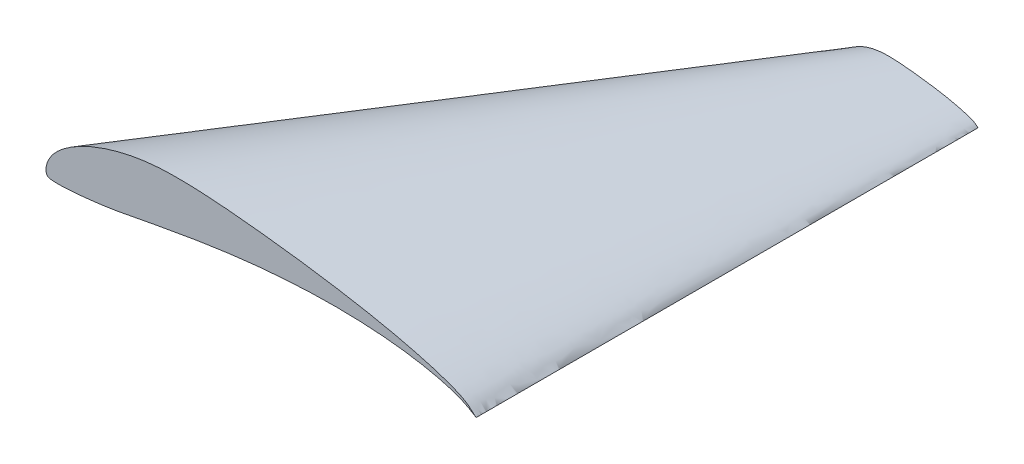
ISO-10303-21;
HEADER;
FILE_DESCRIPTION(('STEP AP214'),'2;1');
FILE_NAME('part.step','',(''),(''),'','','');
FILE_SCHEMA(('AUTOMOTIVE_DESIGN { 1 0 10303 214 1 1 1 1 }'));
ENDSEC;
DATA;
#1=APPLICATION_CONTEXT('core data for automotive mechanical design processes');
#2=APPLICATION_PROTOCOL_DEFINITION('international standard','automotive_design',2000,#1);
#3=PRODUCT_CONTEXT('',#1,'mechanical');
#4=PRODUCT('Part','Part','',(#3));
#5=PRODUCT_RELATED_PRODUCT_CATEGORY('part','',(#4));
#6=PRODUCT_DEFINITION_FORMATION('','',#4);
#7=PRODUCT_DEFINITION_CONTEXT('part definition',#1,'design');
#8=PRODUCT_DEFINITION('design','',#6,#7);
#9=PRODUCT_DEFINITION_SHAPE('','',#8);
#10=(LENGTH_UNIT() NAMED_UNIT(*) SI_UNIT(.MILLI.,.METRE.));
#11=(NAMED_UNIT(*) PLANE_ANGLE_UNIT() SI_UNIT($,.RADIAN.));
#12=(NAMED_UNIT(*) SI_UNIT($,.STERADIAN.) SOLID_ANGLE_UNIT());
#13=UNCERTAINTY_MEASURE_WITH_UNIT(LENGTH_MEASURE(1.E-05),#10,'distance_accuracy_value','');
#14=(GEOMETRIC_REPRESENTATION_CONTEXT(3) GLOBAL_UNCERTAINTY_ASSIGNED_CONTEXT((#13)) GLOBAL_UNIT_ASSIGNED_CONTEXT((#10,
#11,#12)) REPRESENTATION_CONTEXT('',''));
#15=CARTESIAN_POINT('',(0.,0.,0.));
#16=DIRECTION('',(0.,0.,1.));
#17=DIRECTION('',(1.,0.,0.));
#18=AXIS2_PLACEMENT_3D('',#15,#16,#17);
#19=CARTESIAN_POINT('',(0.,0.,0.));
#20=DIRECTION('',(0.,0.,1.));
#21=DIRECTION('',(1.,0.,0.));
#22=AXIS2_PLACEMENT_3D('',#19,#20,#21);
#23=PLANE('',#22);
#24=CARTESIAN_POINT('',(60.,0.,0.));
#25=CARTESIAN_POINT('',(59.9996335008558,-0.00155848421639207,0.));
#26=CARTESIAN_POINT('',(59.7678107009083,0.155812155482037,0.));
#27=CARTESIAN_POINT('',(59.510705283188,0.311289893981384,0.));
#28=CARTESIAN_POINT('',(58.8414335563824,0.71305828177372,0.));
#29=CARTESIAN_POINT('',(57.9336674364374,1.14757460538814,0.));
#30=CARTESIAN_POINT('',(56.6613494668884,1.62238939798338,0.));
#31=CARTESIAN_POINT('',(55.1067027969541,2.06726981959666,0.));
#32=CARTESIAN_POINT('',(53.2880024798237,2.48302860424677,0.));
#33=CARTESIAN_POINT('',(51.2387663269364,2.84900866508274,0.));
#34=CARTESIAN_POINT('',(48.9830207247781,3.15295287632235,0.));
#35=CARTESIAN_POINT('',(46.5501347587453,3.38604192261378,0.));
#36=CARTESIAN_POINT('',(43.9690733929395,3.53932870712883,0.));
#37=CARTESIAN_POINT('',(41.270873524825,3.61083541756505,0.));
#38=CARTESIAN_POINT('',(38.4864311413307,3.59888806789702,0.));
#39=CARTESIAN_POINT('',(35.6468110581785,3.5042984247576,0.));
#40=CARTESIAN_POINT('',(32.7828181702501,3.33224073356768,0.));
#41=CARTESIAN_POINT('',(29.9243738514525,3.08952194695553,0.));
#42=CARTESIAN_POINT('',(27.1001632949703,2.78246131453942,0.));
#43=CARTESIAN_POINT('',(24.3368648292331,2.42484380478589,0.));
#44=CARTESIAN_POINT('',(21.6593280235428,2.02708237663987,0.));
#45=CARTESIAN_POINT('',(19.0906277666481,1.60376835003282,0.));
#46=CARTESIAN_POINT('',(16.650692213626,1.16903728804964,0.));
#47=CARTESIAN_POINT('',(14.3574403385057,0.739204137605637,0.));
#48=CARTESIAN_POINT('',(12.2252761749415,0.332109900745339,0.));
#49=CARTESIAN_POINT('',(10.2646215673956,-0.0419478858174395,0.));
#50=CARTESIAN_POINT('',(8.46567456259763,-0.340243437522128,0.));
#51=CARTESIAN_POINT('',(6.81967624191513,-0.553670124333049,0.));
#52=CARTESIAN_POINT('',(5.3274309804443,-0.720099828376295,0.));
#53=CARTESIAN_POINT('',(3.99621535818404,-0.843103830870702,0.));
#54=CARTESIAN_POINT('',(2.8396514000118,-0.919895750020732,0.));
#55=CARTESIAN_POINT('',(1.8706104555078,-0.961682830343907,0.));
#56=CARTESIAN_POINT('',(1.10004460153965,-0.934581165480218,0.));
#57=CARTESIAN_POINT('',(0.536763933386814,-0.90661835605631,0.));
#58=CARTESIAN_POINT('',(0.117816244960925,-0.707306615975616,0.));
#59=CARTESIAN_POINT('',(0.0051098577528765,-0.305798157678561,0.));
#60=CARTESIAN_POINT('',(-0.0140169847637187,0.131974925650224,0.));
#61=CARTESIAN_POINT('',(0.0850719316488285,0.649582218808172,0.));
#62=CARTESIAN_POINT('',(0.2930234664486,1.21037036917539,0.));
#63=CARTESIAN_POINT('',(0.617494407148315,1.80101400701995,0.));
#64=CARTESIAN_POINT('',(1.05675527613261,2.40813064719845,0.));
#65=CARTESIAN_POINT('',(1.62861455630535,3.01299152689761,0.));
#66=CARTESIAN_POINT('',(2.33035140361199,3.61035853790743,0.));
#67=CARTESIAN_POINT('',(3.15178940082182,4.20675239007223,0.));
#68=CARTESIAN_POINT('',(4.09258962341009,4.78953179393415,0.));
#69=CARTESIAN_POINT('',(5.14685221592727,5.35079958311253,0.));
#70=CARTESIAN_POINT('',(6.30884164347269,5.88417305863267,0.));
#71=CARTESIAN_POINT('',(7.57483146116029,6.37882320453374,0.));
#72=CARTESIAN_POINT('',(8.93695465998708,6.83209986705336,0.));
#73=CARTESIAN_POINT('',(10.3894182556015,7.23340315512576,0.));
#74=CARTESIAN_POINT('',(11.926076695069,7.57562537309296,0.));
#75=CARTESIAN_POINT('',(13.5453512859509,7.839789441016,0.));
#76=CARTESIAN_POINT('',(15.2476328415943,8.02660789751006,0.));
#77=CARTESIAN_POINT('',(17.0398509693804,8.11879768752978,0.));
#78=CARTESIAN_POINT('',(18.9226999256131,8.12377974427893,0.));
#79=CARTESIAN_POINT('',(20.8926674686435,8.07697502334032,0.));
#80=CARTESIAN_POINT('',(22.9396617347882,7.96859227406435,0.));
#81=CARTESIAN_POINT('',(25.052294626095,7.81102981614016,0.));
#82=CARTESIAN_POINT('',(27.2184980068069,7.61270867154978,0.));
#83=CARTESIAN_POINT('',(29.4230365764783,7.38479145195094,0.));
#84=CARTESIAN_POINT('',(31.6479502828675,7.13154383170439,0.));
#85=CARTESIAN_POINT('',(33.8748202071201,6.85935611065016,0.));
#86=CARTESIAN_POINT('',(36.0858440170008,6.56630027476171,0.));
#87=CARTESIAN_POINT('',(38.2650079778576,6.25331693697473,0.));
#88=CARTESIAN_POINT('',(40.3983436281798,5.92287598001367,0.));
#89=CARTESIAN_POINT('',(42.4720640696188,5.57436949248205,0.));
#90=CARTESIAN_POINT('',(44.4741846373565,5.21215240354569,0.));
#91=CARTESIAN_POINT('',(46.3922162813386,4.8372114388325,0.));
#92=CARTESIAN_POINT('',(48.2145350695117,4.45252726033602,0.));
#93=CARTESIAN_POINT('',(49.9318628263046,4.06561454332629,0.));
#94=CARTESIAN_POINT('',(51.5282398733248,3.65993308110928,0.));
#95=CARTESIAN_POINT('',(53.0044503542957,3.27530791932623,0.));
#96=CARTESIAN_POINT('',(54.3426606505066,2.87984653664435,0.));
#97=CARTESIAN_POINT('',(55.5405906841004,2.49165505155028,0.));
#98=CARTESIAN_POINT('',(56.5905605509476,2.11038996867272,0.));
#99=CARTESIAN_POINT('',(57.4879028587413,1.73962008144949,0.));
#100=CARTESIAN_POINT('',(58.2311986071286,1.38431433802317,0.));
#101=CARTESIAN_POINT('',(58.828941407944,1.01769187040323,0.));
#102=CARTESIAN_POINT('',(59.265915035483,0.654017791026096,0.));
#103=CARTESIAN_POINT('',(59.6363051275394,0.312157693204799,0.));
#104=CARTESIAN_POINT('',(59.8031171503171,0.148486190866981,0.));
#105=CARTESIAN_POINT('',(60.0003591967076,0.00152743166866073,0.));
#106=CARTESIAN_POINT('',(60.,0.,0.));
#107=B_SPLINE_CURVE_WITH_KNOTS('',3,(#24,#25,#26,#27,#28,#29,#30,#31,#32,#33,#34,#35,#36,#37,
#38,#39,#40,#41,#42,#43,#44,#45,#46,#47,#48,#49,#50,#51,#52,#53,#54,#55,#56,#57,#58,#59,#60,#61,
#62,#63,#64,#65,#66,#67,#68,#69,#70,#71,#72,#73,#74,#75,#76,#77,#78,#79,#80,#81,#82,#83,#84,#85,
#86,#87,#88,#89,#90,#91,#92,#93,#94,#95,#96,#97,#98,#99,#100,#101,#102,#103,#104,#105,#106),
.UNSPECIFIED.,.T.,.F.,(4,1,1,1,1,1,1,1,1,1,1,1,1,1,1,1,1,1,1,1,1,1,1,1,1,1,1,1,1,1,1,1,1,1,1,1,
1,1,1,1,1,1,1,1,1,1,1,1,1,1,1,1,1,1,1,1,1,1,1,1,1,1,1,1,1,1,1,1,1,1,1,1,1,1,1,1,1,1,1,1,4),(0.,
0.000999595034815837,0.00414743774369519,0.00974821601037268,0.0180443899446245,
0.0288641991996833,0.0418308198350615,0.0567138478942355,0.0733412853564563,0.0915080547107664,
0.111021917177537,0.131661804526869,0.153207825706353,0.175433528799767,0.19811046031293,
0.221011605843273,0.243906058549397,0.266573503450726,0.288810557601415,0.31040526005058,
0.331177982251504,0.350944129706034,0.369556666419457,0.386865242588056,0.402753329919287,
0.417196176920278,0.430379829555338,0.442362952475785,0.45303248251471,0.462284679293247,
0.470026545271628,0.47617698852928,0.480650294346737,0.48355342240639,0.486421040421971,
0.489953585116172,0.494097283387753,0.498850948379478,0.504197114214733,0.51012586039696,
0.51669140420628,0.524012077500029,0.532092506534436,0.540898311322029,0.550403811222182,
0.560581445524391,0.571396895528153,0.582828501640837,0.594830070646116,0.607347475509598,
0.620384772879386,0.63396939421264,0.648200435292775,0.663194415524789,0.678899070821298,
0.695227064221376,0.712113734743953,0.729459932801066,0.747143656172896,0.765010323727239,
0.782905493395852,0.800688622999792,0.81824269546429,0.835449686152564,0.852212235831375,
0.868430205200021,0.884010000974418,0.898855600032139,0.912882485735979,0.926021793563495,
0.938166726306016,0.949289662606352,0.959322142555101,0.968216926505938,0.975948202645329,
0.982474396572986,0.987904714083922,0.992516496078862,0.996351135198454,0.999020321735725,1.),.UNSPECIFIED.);
#108=CARTESIAN_POINT('',(18.1305508783173,8.11874613514222,0.));
#109=VERTEX_POINT('',#108);
#110=CARTESIAN_POINT('',(10.0004529226697,7.12022015254232,0.));
#111=VERTEX_POINT('',#110);
#112=EDGE_CURVE('E66',#109,#111,#107,.F.);
#113=ORIENTED_EDGE('',*,*,#112,.T.);
#114=CARTESIAN_POINT('',(60.,0.,0.));
#115=CARTESIAN_POINT('',(60.0003591967076,0.00152743166866113,0.));
#116=CARTESIAN_POINT('',(59.8031171503171,0.148486190866981,0.));
#117=CARTESIAN_POINT('',(59.6363051275394,0.312157693204799,0.));
#118=CARTESIAN_POINT('',(59.265915035483,0.654017791026096,0.));
#119=CARTESIAN_POINT('',(58.828941407944,1.01769187040323,0.));
#120=CARTESIAN_POINT('',(58.2311986071286,1.38431433802317,0.));
#121=CARTESIAN_POINT('',(57.4879028587413,1.73962008144949,0.));
#122=CARTESIAN_POINT('',(56.5905605509476,2.11038996867272,0.));
#123=CARTESIAN_POINT('',(55.5405906841004,2.49165505155028,0.));
#124=CARTESIAN_POINT('',(54.3426606505066,2.87984653664435,0.));
#125=CARTESIAN_POINT('',(53.0044503542957,3.27530791932623,0.));
#126=CARTESIAN_POINT('',(51.5282398733248,3.65993308110928,0.));
#127=CARTESIAN_POINT('',(49.9318628263046,4.06561454332629,0.));
#128=CARTESIAN_POINT('',(48.2145350695117,4.45252726033602,0.));
#129=CARTESIAN_POINT('',(46.3922162813386,4.8372114388325,0.));
#130=CARTESIAN_POINT('',(44.4741846373565,5.21215240354569,0.));
#131=CARTESIAN_POINT('',(42.4720640696188,5.57436949248205,0.));
#132=CARTESIAN_POINT('',(40.3983436281798,5.92287598001367,0.));
#133=CARTESIAN_POINT('',(38.2650079778576,6.25331693697473,0.));
#134=CARTESIAN_POINT('',(36.0858440170008,6.56630027476171,0.));
#135=CARTESIAN_POINT('',(33.8748202071201,6.85935611065016,0.));
#136=CARTESIAN_POINT('',(31.6479502828675,7.13154383170439,0.));
#137=CARTESIAN_POINT('',(29.4230365764783,7.38479145195094,0.));
#138=CARTESIAN_POINT('',(27.2184980068069,7.61270867154978,0.));
#139=CARTESIAN_POINT('',(25.052294626095,7.81102981614016,0.));
#140=CARTESIAN_POINT('',(22.9396617347882,7.96859227406435,0.));
#141=CARTESIAN_POINT('',(20.8926674686435,8.07697502334032,0.));
#142=CARTESIAN_POINT('',(18.9226999256131,8.12377974427893,0.));
#143=CARTESIAN_POINT('',(17.0398509693804,8.11879768752978,0.));
#144=CARTESIAN_POINT('',(15.2476328415943,8.02660789751006,0.));
#145=CARTESIAN_POINT('',(13.5453512859509,7.839789441016,0.));
#146=CARTESIAN_POINT('',(11.926076695069,7.57562537309296,0.));
#147=CARTESIAN_POINT('',(10.3894182556015,7.23340315512576,0.));
#148=CARTESIAN_POINT('',(8.93695465998708,6.83209986705336,0.));
#149=CARTESIAN_POINT('',(7.57483146116029,6.37882320453374,0.));
#150=CARTESIAN_POINT('',(6.30884164347269,5.88417305863267,0.));
#151=CARTESIAN_POINT('',(5.14685221592727,5.35079958311253,0.));
#152=CARTESIAN_POINT('',(4.09258962341009,4.78953179393415,0.));
#153=CARTESIAN_POINT('',(3.15178940082182,4.20675239007223,0.));
#154=CARTESIAN_POINT('',(2.33035140361199,3.61035853790743,0.));
#155=CARTESIAN_POINT('',(1.62861455630535,3.01299152689761,0.));
#156=CARTESIAN_POINT('',(1.05675527613261,2.40813064719845,0.));
#157=CARTESIAN_POINT('',(0.617494407148315,1.80101400701995,0.));
#158=CARTESIAN_POINT('',(0.2930234664486,1.21037036917539,0.));
#159=CARTESIAN_POINT('',(0.0850719316488285,0.649582218808172,0.));
#160=CARTESIAN_POINT('',(-0.0140169847637187,0.131974925650224,0.));
#161=CARTESIAN_POINT('',(0.0051098577528765,-0.305798157678561,0.));
#162=CARTESIAN_POINT('',(0.117816244960925,-0.707306615975616,0.));
#163=CARTESIAN_POINT('',(0.536763933386814,-0.90661835605631,0.));
#164=CARTESIAN_POINT('',(1.10004460153965,-0.934581165480218,0.));
#165=CARTESIAN_POINT('',(1.8706104555078,-0.961682830343907,0.));
#166=CARTESIAN_POINT('',(2.8396514000118,-0.919895750020732,0.));
#167=CARTESIAN_POINT('',(3.99621535818404,-0.843103830870702,0.));
#168=CARTESIAN_POINT('',(5.3274309804443,-0.720099828376295,0.));
#169=CARTESIAN_POINT('',(6.81967624191513,-0.553670124333049,0.));
#170=CARTESIAN_POINT('',(8.46567456259763,-0.340243437522128,0.));
#171=CARTESIAN_POINT('',(10.2646215673956,-0.0419478858174395,0.));
#172=CARTESIAN_POINT('',(12.2252761749415,0.332109900745339,0.));
#173=CARTESIAN_POINT('',(14.3574403385057,0.739204137605637,0.));
#174=CARTESIAN_POINT('',(16.650692213626,1.16903728804964,0.));
#175=CARTESIAN_POINT('',(19.0906277666481,1.60376835003282,0.));
#176=CARTESIAN_POINT('',(21.6593280235428,2.02708237663987,0.));
#177=CARTESIAN_POINT('',(24.3368648292331,2.42484380478589,0.));
#178=CARTESIAN_POINT('',(27.1001632949703,2.78246131453942,0.));
#179=CARTESIAN_POINT('',(29.9243738514525,3.08952194695553,0.));
#180=CARTESIAN_POINT('',(32.7828181702501,3.33224073356768,0.));
#181=CARTESIAN_POINT('',(35.6468110581785,3.5042984247576,0.));
#182=CARTESIAN_POINT('',(38.4864311413307,3.59888806789702,0.));
#183=CARTESIAN_POINT('',(41.270873524825,3.61083541756505,0.));
#184=CARTESIAN_POINT('',(43.9690733929395,3.53932870712883,0.));
#185=CARTESIAN_POINT('',(46.5501347587453,3.38604192261378,0.));
#186=CARTESIAN_POINT('',(48.9830207247781,3.15295287632235,0.));
#187=CARTESIAN_POINT('',(51.2387663269364,2.84900866508274,0.));
#188=CARTESIAN_POINT('',(53.2880024798237,2.48302860424677,0.));
#189=CARTESIAN_POINT('',(55.1067027969541,2.06726981959666,0.));
#190=CARTESIAN_POINT('',(56.6613494668884,1.62238939798338,0.));
#191=CARTESIAN_POINT('',(57.9336674364374,1.14757460538814,0.));
#192=CARTESIAN_POINT('',(58.8414335563824,0.71305828177372,0.));
#193=CARTESIAN_POINT('',(59.510705283188,0.311289893981384,0.));
#194=CARTESIAN_POINT('',(59.7678107009083,0.155812155482037,0.));
#195=CARTESIAN_POINT('',(59.9996335008558,-0.00155848421639207,0.));
#196=CARTESIAN_POINT('',(60.,0.,0.));
#197=B_SPLINE_CURVE_WITH_KNOTS('',3,(#114,#115,#116,#117,#118,#119,#120,#121,#122,#123,#124,
#125,#126,#127,#128,#129,#130,#131,#132,#133,#134,#135,#136,#137,#138,#139,#140,#141,#142,#143,
#144,#145,#146,#147,#148,#149,#150,#151,#152,#153,#154,#155,#156,#157,#158,#159,#160,#161,#162,
#163,#164,#165,#166,#167,#168,#169,#170,#171,#172,#173,#174,#175,#176,#177,#178,#179,#180,#181,
#182,#183,#184,#185,#186,#187,#188,#189,#190,#191,#192,#193,#194,#195,#196),.UNSPECIFIED.,.T.,
.F.,(4,1,1,1,1,1,1,1,1,1,1,1,1,1,1,1,1,1,1,1,1,1,1,1,1,1,1,1,1,1,1,1,1,1,1,1,1,1,1,1,1,1,1,1,1,
1,1,1,1,1,1,1,1,1,1,1,1,1,1,1,1,1,1,1,1,1,1,1,1,1,1,1,1,1,1,1,1,1,1,1,4),(0.,
0.000979678264274593,0.00364886480154598,0.0074835039211375,0.0120952859160778,
0.0175256034270145,0.0240517973546713,0.0317830734940624,0.0406778574448995,0.0507103373936484,
0.0618332736939838,0.0739782064365048,0.0871175142640213,0.101144399967861,0.115989999025582,
0.131569794799979,0.147787764168625,0.164550313847436,0.18175730453571,0.199311377000208,
0.217094506604148,0.234989676272761,0.252856343827104,0.270540067198934,0.287886265256047,
0.304772935778624,0.321100929178702,0.336805584475211,0.351799564707225,0.36603060578736,
0.379615227120614,0.392652524490402,0.405169929353884,0.417171498359163,0.428603104471847,
0.439418554475609,0.449596188777818,0.459101688677971,0.467907493465564,0.475987922499971,
0.48330859579372,0.48987413960304,0.495802885785267,0.501149051620522,0.505902716612247,
0.510046414883828,0.513578959578029,0.51644657759361,0.519349705653263,0.52382301147072,
0.529973454728372,0.537715320706753,0.54696751748529,0.557637047524215,0.569620170444662,
0.582803823079722,0.597246670080713,0.613134757411944,0.630443333580543,0.649055870293966,
0.668822017748496,0.68959473994942,0.711189442398585,0.733426496549274,0.756093941450603,
0.778988394156727,0.80188953968707,0.824566471200233,0.846792174293647,0.868338195473131,
0.888978082822463,0.908491945289234,0.926658714643544,0.943286152105764,0.958169180164938,
0.971135800800317,0.981955610055375,0.990251783989627,0.995852562256305,0.999000404965184,1.),.UNSPECIFIED.);
#198=CARTESIAN_POINT('',(10.000052664569,-0.0805894482553418,0.));
#199=VERTEX_POINT('',#198);
#200=EDGE_CURVE('E56',#111,#199,#197,.T.);
#201=ORIENTED_EDGE('',*,*,#200,.T.);
#202=CARTESIAN_POINT('',(60.,0.,0.));
#203=CARTESIAN_POINT('',(59.9996335008558,-0.00155848421639207,0.));
#204=CARTESIAN_POINT('',(59.7678107009083,0.155812155482037,0.));
#205=CARTESIAN_POINT('',(59.510705283188,0.311289893981384,0.));
#206=CARTESIAN_POINT('',(58.8414335563824,0.71305828177372,0.));
#207=CARTESIAN_POINT('',(57.9336674364374,1.14757460538814,0.));
#208=CARTESIAN_POINT('',(56.6613494668884,1.62238939798338,0.));
#209=CARTESIAN_POINT('',(55.1067027969541,2.06726981959666,0.));
#210=CARTESIAN_POINT('',(53.2880024798237,2.48302860424677,0.));
#211=CARTESIAN_POINT('',(51.2387663269364,2.84900866508274,0.));
#212=CARTESIAN_POINT('',(48.9830207247781,3.15295287632235,0.));
#213=CARTESIAN_POINT('',(46.5501347587453,3.38604192261378,0.));
#214=CARTESIAN_POINT('',(43.9690733929395,3.53932870712883,0.));
#215=CARTESIAN_POINT('',(41.270873524825,3.61083541756505,0.));
#216=CARTESIAN_POINT('',(38.4864311413307,3.59888806789702,0.));
#217=CARTESIAN_POINT('',(35.6468110581785,3.5042984247576,0.));
#218=CARTESIAN_POINT('',(32.7828181702501,3.33224073356768,0.));
#219=CARTESIAN_POINT('',(29.9243738514525,3.08952194695553,0.));
#220=CARTESIAN_POINT('',(27.1001632949703,2.78246131453942,0.));
#221=CARTESIAN_POINT('',(24.3368648292331,2.42484380478589,0.));
#222=CARTESIAN_POINT('',(21.6593280235428,2.02708237663987,0.));
#223=CARTESIAN_POINT('',(19.0906277666481,1.60376835003282,0.));
#224=CARTESIAN_POINT('',(16.650692213626,1.16903728804964,0.));
#225=CARTESIAN_POINT('',(14.3574403385057,0.739204137605637,0.));
#226=CARTESIAN_POINT('',(12.2252761749415,0.332109900745339,0.));
#227=CARTESIAN_POINT('',(10.2646215673956,-0.0419478858174395,0.));
#228=CARTESIAN_POINT('',(8.46567456259763,-0.340243437522128,0.));
#229=CARTESIAN_POINT('',(6.81967624191513,-0.553670124333049,0.));
#230=CARTESIAN_POINT('',(5.3274309804443,-0.720099828376295,0.));
#231=CARTESIAN_POINT('',(3.99621535818404,-0.843103830870702,0.));
#232=CARTESIAN_POINT('',(2.8396514000118,-0.919895750020732,0.));
#233=CARTESIAN_POINT('',(1.8706104555078,-0.961682830343907,0.));
#234=CARTESIAN_POINT('',(1.10004460153965,-0.934581165480218,0.));
#235=CARTESIAN_POINT('',(0.536763933386814,-0.90661835605631,0.));
#236=CARTESIAN_POINT('',(0.117816244960925,-0.707306615975616,0.));
#237=CARTESIAN_POINT('',(0.0051098577528765,-0.305798157678561,0.));
#238=CARTESIAN_POINT('',(-0.0140169847637187,0.131974925650224,0.));
#239=CARTESIAN_POINT('',(0.0850719316488285,0.649582218808172,0.));
#240=CARTESIAN_POINT('',(0.2930234664486,1.21037036917539,0.));
#241=CARTESIAN_POINT('',(0.617494407148315,1.80101400701995,0.));
#242=CARTESIAN_POINT('',(1.05675527613261,2.40813064719845,0.));
#243=CARTESIAN_POINT('',(1.62861455630535,3.01299152689761,0.));
#244=CARTESIAN_POINT('',(2.33035140361199,3.61035853790743,0.));
#245=CARTESIAN_POINT('',(3.15178940082182,4.20675239007223,0.));
#246=CARTESIAN_POINT('',(4.09258962341009,4.78953179393415,0.));
#247=CARTESIAN_POINT('',(5.14685221592727,5.35079958311253,0.));
#248=CARTESIAN_POINT('',(6.30884164347269,5.88417305863267,0.));
#249=CARTESIAN_POINT('',(7.57483146116029,6.37882320453374,0.));
#250=CARTESIAN_POINT('',(8.93695465998708,6.83209986705336,0.));
#251=CARTESIAN_POINT('',(10.3894182556015,7.23340315512576,0.));
#252=CARTESIAN_POINT('',(11.926076695069,7.57562537309296,0.));
#253=CARTESIAN_POINT('',(13.5453512859509,7.839789441016,0.));
#254=CARTESIAN_POINT('',(15.2476328415943,8.02660789751006,0.));
#255=CARTESIAN_POINT('',(17.0398509693804,8.11879768752978,0.));
#256=CARTESIAN_POINT('',(18.9226999256131,8.12377974427893,0.));
#257=CARTESIAN_POINT('',(20.8926674686435,8.07697502334032,0.));
#258=CARTESIAN_POINT('',(22.9396617347882,7.96859227406435,0.));
#259=CARTESIAN_POINT('',(25.052294626095,7.81102981614016,0.));
#260=CARTESIAN_POINT('',(27.2184980068069,7.61270867154978,0.));
#261=CARTESIAN_POINT('',(29.4230365764783,7.38479145195094,0.));
#262=CARTESIAN_POINT('',(31.6479502828675,7.13154383170439,0.));
#263=CARTESIAN_POINT('',(33.8748202071201,6.85935611065016,0.));
#264=CARTESIAN_POINT('',(36.0858440170008,6.56630027476171,0.));
#265=CARTESIAN_POINT('',(38.2650079778576,6.25331693697473,0.));
#266=CARTESIAN_POINT('',(40.3983436281798,5.92287598001367,0.));
#267=CARTESIAN_POINT('',(42.4720640696188,5.57436949248205,0.));
#268=CARTESIAN_POINT('',(44.4741846373565,5.21215240354569,0.));
#269=CARTESIAN_POINT('',(46.3922162813386,4.8372114388325,0.));
#270=CARTESIAN_POINT('',(48.2145350695117,4.45252726033602,0.));
#271=CARTESIAN_POINT('',(49.9318628263046,4.06561454332629,0.));
#272=CARTESIAN_POINT('',(51.5282398733248,3.65993308110928,0.));
#273=CARTESIAN_POINT('',(53.0044503542957,3.27530791932623,0.));
#274=CARTESIAN_POINT('',(54.3426606505066,2.87984653664435,0.));
#275=CARTESIAN_POINT('',(55.5405906841004,2.49165505155028,0.));
#276=CARTESIAN_POINT('',(56.5905605509476,2.11038996867272,0.));
#277=CARTESIAN_POINT('',(57.4879028587413,1.73962008144949,0.));
#278=CARTESIAN_POINT('',(58.2311986071286,1.38431433802317,0.));
#279=CARTESIAN_POINT('',(58.828941407944,1.01769187040323,0.));
#280=CARTESIAN_POINT('',(59.265915035483,0.654017791026096,0.));
#281=CARTESIAN_POINT('',(59.6363051275394,0.312157693204799,0.));
#282=CARTESIAN_POINT('',(59.8031171503171,0.148486190866981,0.));
#283=CARTESIAN_POINT('',(60.0003591967076,0.00152743166866073,0.));
#284=CARTESIAN_POINT('',(60.,0.,0.));
#285=B_SPLINE_CURVE_WITH_KNOTS('',3,(#202,#203,#204,#205,#206,#207,#208,#209,#210,#211,#212,
#213,#214,#215,#216,#217,#218,#219,#220,#221,#222,#223,#224,#225,#226,#227,#228,#229,#230,#231,
#232,#233,#234,#235,#236,#237,#238,#239,#240,#241,#242,#243,#244,#245,#246,#247,#248,#249,#250,
#251,#252,#253,#254,#255,#256,#257,#258,#259,#260,#261,#262,#263,#264,#265,#266,#267,#268,#269,
#270,#271,#272,#273,#274,#275,#276,#277,#278,#279,#280,#281,#282,#283,#284),.UNSPECIFIED.,.T.,
.F.,(4,1,1,1,1,1,1,1,1,1,1,1,1,1,1,1,1,1,1,1,1,1,1,1,1,1,1,1,1,1,1,1,1,1,1,1,1,1,1,1,1,1,1,1,1,
1,1,1,1,1,1,1,1,1,1,1,1,1,1,1,1,1,1,1,1,1,1,1,1,1,1,1,1,1,1,1,1,1,1,1,4),(0.,
0.000999595034815837,0.00414743774369519,0.00974821601037268,0.0180443899446245,
0.0288641991996833,0.0418308198350615,0.0567138478942355,0.0733412853564563,0.0915080547107664,
0.111021917177537,0.131661804526869,0.153207825706353,0.175433528799767,0.19811046031293,
0.221011605843273,0.243906058549397,0.266573503450726,0.288810557601415,0.31040526005058,
0.331177982251504,0.350944129706034,0.369556666419457,0.386865242588056,0.402753329919287,
0.417196176920278,0.430379829555338,0.442362952475785,0.45303248251471,0.462284679293247,
0.470026545271628,0.47617698852928,0.480650294346737,0.48355342240639,0.486421040421971,
0.489953585116172,0.494097283387753,0.498850948379478,0.504197114214733,0.51012586039696,
0.51669140420628,0.524012077500029,0.532092506534436,0.540898311322029,0.550403811222182,
0.560581445524391,0.571396895528153,0.582828501640837,0.594830070646116,0.607347475509598,
0.620384772879386,0.63396939421264,0.648200435292775,0.663194415524789,0.678899070821298,
0.695227064221376,0.712113734743953,0.729459932801066,0.747143656172896,0.765010323727239,
0.782905493395852,0.800688622999792,0.81824269546429,0.835449686152564,0.852212235831375,
0.868430205200021,0.884010000974418,0.898855600032139,0.912882485735979,0.926021793563495,
0.938166726306016,0.949289662606352,0.959322142555101,0.968216926505938,0.975948202645329,
0.982474396572986,0.987904714083922,0.992516496078862,0.996351135198454,0.999020321735725,1.),.UNSPECIFIED.);
#286=CARTESIAN_POINT('',(20.8980664324314,1.89887784310203,0.));
#287=VERTEX_POINT('',#286);
#288=EDGE_CURVE('E64',#199,#287,#285,.F.);
#289=ORIENTED_EDGE('',*,*,#288,.T.);
#290=EDGE_CURVE('E43',#287,#109,#197,.T.);
#291=ORIENTED_EDGE('',*,*,#290,.T.);
#292=EDGE_LOOP('',(#113,#201,#289,#291));
#293=FACE_BOUND('',#292,.T.);
#294=ADVANCED_FACE('F33',(#293),#23,.T.);
#295=CARTESIAN_POINT('',(42.1075946681816,0.393611507106538,-70.));
#296=DIRECTION('',(0.,0.,1.));
#297=DIRECTION('',(-1.,0.,0.));
#298=AXIS2_PLACEMENT_3D('',#295,#296,#297);
#299=PLANE('',#298);
#300=CARTESIAN_POINT('',(60.,0.,-70.));
#301=CARTESIAN_POINT('',(60.0001077590123,0.00045822950059834,-70.));
#302=CARTESIAN_POINT('',(59.9409351450951,0.0445458572600942,-70.));
#303=CARTESIAN_POINT('',(59.8908915382618,0.0936473079614398,-70.));
#304=CARTESIAN_POINT('',(59.7797745106449,0.196205337307829,-70.));
#305=CARTESIAN_POINT('',(59.6486824223832,0.305307561120969,-70.));
#306=CARTESIAN_POINT('',(59.4693595821386,0.415294301406952,-70.));
#307=CARTESIAN_POINT('',(59.2463708576224,0.521886024434847,-70.));
#308=CARTESIAN_POINT('',(58.9771681652843,0.633116990601815,-70.));
#309=CARTESIAN_POINT('',(58.6621772052301,0.747496515465083,-70.));
#310=CARTESIAN_POINT('',(58.302798195152,0.863953960993304,-70.));
#311=CARTESIAN_POINT('',(57.9013351062887,0.982592375797868,-70.));
#312=CARTESIAN_POINT('',(57.4584719619975,1.09797992433278,-70.));
#313=CARTESIAN_POINT('',(56.9795588478914,1.21968436299789,-70.));
#314=CARTESIAN_POINT('',(56.4643605208535,1.33575817810081,-70.));
#315=CARTESIAN_POINT('',(55.9176648844016,1.45116343164975,-70.));
#316=CARTESIAN_POINT('',(55.3422553912069,1.56364572106371,-70.));
#317=CARTESIAN_POINT('',(54.7416192208856,1.67231084774462,-70.));
#318=CARTESIAN_POINT('',(54.119503088454,1.7768627940041,-70.));
#319=CARTESIAN_POINT('',(53.4795023933573,1.87599508109242,-70.));
#320=CARTESIAN_POINT('',(52.8257532051002,1.96989008242851,-70.));
#321=CARTESIAN_POINT('',(52.162446062136,2.05780683319505,-70.));
#322=CARTESIAN_POINT('',(51.4943850848603,2.13946314951132,-70.));
#323=CARTESIAN_POINT('',(50.8269109729435,2.21543743558528,-70.));
#324=CARTESIAN_POINT('',(50.1655494020421,2.28381260146493,-70.));
#325=CARTESIAN_POINT('',(49.5156883878285,2.34330894484205,-70.));
#326=CARTESIAN_POINT('',(48.8818985204364,2.39057768221931,-70.));
#327=CARTESIAN_POINT('',(48.2678002405931,2.42309250700209,-70.));
#328=CARTESIAN_POINT('',(47.6768099776839,2.43713392328368,-70.));
#329=CARTESIAN_POINT('',(47.1119552908141,2.43563930625894,-70.));
#330=CARTESIAN_POINT('',(46.5742898524783,2.40798236925302,-70.));
#331=CARTESIAN_POINT('',(46.0636053857853,2.3519368323048,-70.));
#332=CARTESIAN_POINT('',(45.5778230085207,2.27268761192789,-70.));
#333=CARTESIAN_POINT('',(45.1168254766805,2.17002094653773,-70.));
#334=CARTESIAN_POINT('',(44.6810863979961,2.04962996011601,-70.));
#335=CARTESIAN_POINT('',(44.2724494383481,1.91364696136012,-70.));
#336=CARTESIAN_POINT('',(43.8926524930418,1.7652519175898,-70.));
#337=CARTESIAN_POINT('',(43.5440556647782,1.60523987493376,-70.));
#338=CARTESIAN_POINT('',(43.227776887023,1.43685953818025,-70.));
#339=CARTESIAN_POINT('',(42.9455368202465,1.26202571702167,-70.));
#340=CARTESIAN_POINT('',(42.6991054210836,1.08310756137223,-70.));
#341=CARTESIAN_POINT('',(42.4885843668916,0.903897458069282,-70.));
#342=CARTESIAN_POINT('',(42.3170265828398,0.722439194159534,-70.));
#343=CARTESIAN_POINT('',(42.1852483221445,0.540304202105985,-70.));
#344=CARTESIAN_POINT('',(42.0879070399346,0.363111110752618,-70.));
#345=CARTESIAN_POINT('',(42.0255215794946,0.194874665642452,-70.));
#346=CARTESIAN_POINT('',(41.9957949045709,0.0395924776950672,-70.));
#347=CARTESIAN_POINT('',(42.0015329573259,-0.0917394473035684,-70.));
#348=CARTESIAN_POINT('',(42.0353448734883,-0.212191984792685,-70.));
#349=CARTESIAN_POINT('',(42.161029180016,-0.271985506816893,-70.));
#350=CARTESIAN_POINT('',(42.3300133804619,-0.280374349644065,-70.));
#351=CARTESIAN_POINT('',(42.5611831366523,-0.288504849103172,-70.));
#352=CARTESIAN_POINT('',(42.8518954200035,-0.27596872500622,-70.));
#353=CARTESIAN_POINT('',(43.1988646074552,-0.252931149261211,-70.));
#354=CARTESIAN_POINT('',(43.5982292941333,-0.216029948512889,-70.));
#355=CARTESIAN_POINT('',(44.0459028725745,-0.166101037299915,-70.));
#356=CARTESIAN_POINT('',(44.5397023687793,-0.102073031256638,-70.));
#357=CARTESIAN_POINT('',(45.0793864702187,-0.0125843657452318,-70.));
#358=CARTESIAN_POINT('',(45.6675828524825,0.0996329702236017,-70.));
#359=CARTESIAN_POINT('',(46.3072321015517,0.221761241281691,-70.));
#360=CARTESIAN_POINT('',(46.9952076640878,0.350711186414893,-70.));
#361=CARTESIAN_POINT('',(47.7271883299944,0.481130505009847,-70.));
#362=CARTESIAN_POINT('',(48.4977984070628,0.608124712991961,-70.));
#363=CARTESIAN_POINT('',(49.3010594487699,0.727453141435768,-70.));
#364=CARTESIAN_POINT('',(50.1300489884911,0.834738394361826,-70.));
#365=CARTESIAN_POINT('',(50.9773121554357,0.926856584086659,-70.));
#366=CARTESIAN_POINT('',(51.834845451075,0.999672220070305,-70.));
#367=CARTESIAN_POINT('',(52.6940433174535,1.05128952742728,-70.));
#368=CARTESIAN_POINT('',(53.5459293423992,1.07966642036911,-70.));
#369=CARTESIAN_POINT('',(54.3812620574475,1.08325062526952,-70.));
#370=CARTESIAN_POINT('',(55.1907220178818,1.06179861213865,-70.));
#371=CARTESIAN_POINT('',(55.9650404276236,1.01581257678414,-70.));
#372=CARTESIAN_POINT('',(56.6949062174334,0.945885862896706,-70.));
#373=CARTESIAN_POINT('',(57.3716298980809,0.854702599524822,-70.));
#374=CARTESIAN_POINT('',(57.9864007439471,0.744908581274031,-70.));
#375=CARTESIAN_POINT('',(58.5320108390862,0.620180945878999,-70.));
#376=CARTESIAN_POINT('',(58.9984048400665,0.486716819395014,-70.));
#377=CARTESIAN_POINT('',(59.3801002309312,0.344272381616441,-70.));
#378=CARTESIAN_POINT('',(59.6524300669147,0.213917484532116,-70.));
#379=CARTESIAN_POINT('',(59.8532115849564,0.0933869681944152,-70.));
#380=CARTESIAN_POINT('',(59.9303432102725,0.0467436466446112,-70.));
#381=CARTESIAN_POINT('',(59.9998900502568,-0.000467545264917618,-70.));
#382=CARTESIAN_POINT('',(60.,0.,-70.));
#383=B_SPLINE_CURVE_WITH_KNOTS('',3,(#300,#301,#302,#303,#304,#305,#306,#307,#308,#309,#310,
#311,#312,#313,#314,#315,#316,#317,#318,#319,#320,#321,#322,#323,#324,#325,#326,#327,#328,#329,
#330,#331,#332,#333,#334,#335,#336,#337,#338,#339,#340,#341,#342,#343,#344,#345,#346,#347,#348,
#349,#350,#351,#352,#353,#354,#355,#356,#357,#358,#359,#360,#361,#362,#363,#364,#365,#366,#367,
#368,#369,#370,#371,#372,#373,#374,#375,#376,#377,#378,#379,#380,#381,#382),.UNSPECIFIED.,.T.,
.F.,(4,1,1,1,1,1,1,1,1,1,1,1,1,1,1,1,1,1,1,1,1,1,1,1,1,1,1,1,1,1,1,1,1,1,1,1,1,1,1,1,1,1,1,1,1,
1,1,1,1,1,1,1,1,1,1,1,1,1,1,1,1,1,1,1,1,1,1,1,1,1,1,1,1,1,1,1,1,1,1,1,4),(0.,
0.000979678264274593,0.00364886480154598,0.0074835039211375,0.0120952859160778,
0.0175256034270145,0.0240517973546713,0.0317830734940624,0.0406778574448995,0.0507103373936484,
0.0618332736939838,0.0739782064365048,0.0871175142640213,0.101144399967861,0.115989999025582,
0.131569794799979,0.147787764168625,0.164550313847436,0.18175730453571,0.199311377000208,
0.217094506604148,0.234989676272761,0.252856343827104,0.270540067198934,0.287886265256047,
0.304772935778624,0.321100929178702,0.336805584475211,0.351799564707225,0.36603060578736,
0.379615227120614,0.392652524490402,0.405169929353884,0.417171498359163,0.428603104471847,
0.439418554475609,0.449596188777818,0.459101688677971,0.467907493465564,0.475987922499971,
0.48330859579372,0.48987413960304,0.495802885785267,0.501149051620522,0.505902716612247,
0.510046414883828,0.513578959578029,0.51644657759361,0.519349705653263,0.52382301147072,
0.529973454728372,0.537715320706753,0.54696751748529,0.557637047524215,0.569620170444662,
0.582803823079722,0.597246670080713,0.613134757411944,0.630443333580543,0.649055870293966,
0.668822017748496,0.68959473994942,0.711189442398585,0.733426496549274,0.756093941450603,
0.778988394156727,0.80188953968707,0.824566471200233,0.846792174293647,0.868338195473131,
0.888978082822463,0.908491945289234,0.926658714643544,0.943286152105764,0.958169180164938,
0.971135800800317,0.981955610055375,0.990251783989627,0.995852562256305,0.999000404965184,1.),.UNSPECIFIED.);
#384=CARTESIAN_POINT('',(60.,0.,-70.));
#385=VERTEX_POINT('',#384);
#386=EDGE_CURVE('E11',#385,#385,#383,.T.);
#387=ORIENTED_EDGE('',*,*,#386,.F.);
#388=EDGE_LOOP('',(#387));
#389=FACE_BOUND('',#388,.T.);
#390=ADVANCED_FACE('F94',(#389),#299,.F.);
#391=CARTESIAN_POINT('',(60.,0.,-70.));
#392=CARTESIAN_POINT('',(60.,0.,0.));
#393=CARTESIAN_POINT('',(59.9998900502568,-0.000467545264917618,-70.));
#394=CARTESIAN_POINT('',(59.9996335008558,-0.00155848421639207,0.));
#395=CARTESIAN_POINT('',(59.9303432102725,0.0467436466446112,-70.));
#396=CARTESIAN_POINT('',(59.7678107009083,0.155812155482037,0.));
#397=CARTESIAN_POINT('',(59.8532115849564,0.0933869681944152,-70.));
#398=CARTESIAN_POINT('',(59.510705283188,0.311289893981384,0.));
#399=CARTESIAN_POINT('',(59.6524300669147,0.213917484532116,-70.));
#400=CARTESIAN_POINT('',(58.8414335563824,0.71305828177372,0.));
#401=CARTESIAN_POINT('',(59.3801002309312,0.344272381616441,-70.));
#402=CARTESIAN_POINT('',(57.9336674364374,1.14757460538814,0.));
#403=CARTESIAN_POINT('',(58.9984048400665,0.486716819395014,-70.));
#404=CARTESIAN_POINT('',(56.6613494668884,1.62238939798338,0.));
#405=CARTESIAN_POINT('',(58.5320108390862,0.620180945878999,-70.));
#406=CARTESIAN_POINT('',(55.1067027969541,2.06726981959666,0.));
#407=CARTESIAN_POINT('',(57.9864007439471,0.744908581274031,-70.));
#408=CARTESIAN_POINT('',(53.2880024798237,2.48302860424677,0.));
#409=CARTESIAN_POINT('',(57.3716298980809,0.854702599524822,-70.));
#410=CARTESIAN_POINT('',(51.2387663269364,2.84900866508274,0.));
#411=CARTESIAN_POINT('',(56.6949062174334,0.945885862896706,-70.));
#412=CARTESIAN_POINT('',(48.9830207247781,3.15295287632235,0.));
#413=CARTESIAN_POINT('',(55.9650404276236,1.01581257678414,-70.));
#414=CARTESIAN_POINT('',(46.5501347587453,3.38604192261378,0.));
#415=CARTESIAN_POINT('',(55.1907220178818,1.06179861213865,-70.));
#416=CARTESIAN_POINT('',(43.9690733929395,3.53932870712883,0.));
#417=CARTESIAN_POINT('',(54.3812620574475,1.08325062526952,-70.));
#418=CARTESIAN_POINT('',(41.270873524825,3.61083541756505,0.));
#419=CARTESIAN_POINT('',(53.5459293423992,1.07966642036911,-70.));
#420=CARTESIAN_POINT('',(38.4864311413307,3.59888806789702,0.));
#421=CARTESIAN_POINT('',(52.6940433174535,1.05128952742728,-70.));
#422=CARTESIAN_POINT('',(35.6468110581785,3.5042984247576,0.));
#423=CARTESIAN_POINT('',(51.834845451075,0.999672220070305,-70.));
#424=CARTESIAN_POINT('',(32.7828181702501,3.33224073356768,0.));
#425=CARTESIAN_POINT('',(50.9773121554357,0.926856584086659,-70.));
#426=CARTESIAN_POINT('',(29.9243738514525,3.08952194695553,0.));
#427=CARTESIAN_POINT('',(50.1300489884911,0.834738394361826,-70.));
#428=CARTESIAN_POINT('',(27.1001632949703,2.78246131453942,0.));
#429=CARTESIAN_POINT('',(49.3010594487699,0.727453141435768,-70.));
#430=CARTESIAN_POINT('',(24.3368648292331,2.42484380478589,0.));
#431=CARTESIAN_POINT('',(48.4977984070628,0.608124712991961,-70.));
#432=CARTESIAN_POINT('',(21.6593280235428,2.02708237663987,0.));
#433=CARTESIAN_POINT('',(47.7271883299944,0.481130505009847,-70.));
#434=CARTESIAN_POINT('',(19.0906277666481,1.60376835003282,0.));
#435=CARTESIAN_POINT('',(46.9952076640878,0.350711186414893,-70.));
#436=CARTESIAN_POINT('',(16.650692213626,1.16903728804964,0.));
#437=CARTESIAN_POINT('',(46.3072321015517,0.221761241281691,-70.));
#438=CARTESIAN_POINT('',(14.3574403385057,0.739204137605637,0.));
#439=CARTESIAN_POINT('',(45.6675828524825,0.0996329702236017,-70.));
#440=CARTESIAN_POINT('',(12.2252761749415,0.332109900745339,0.));
#441=CARTESIAN_POINT('',(45.0793864702187,-0.0125843657452318,-70.));
#442=CARTESIAN_POINT('',(10.2646215673956,-0.0419478858174395,0.));
#443=CARTESIAN_POINT('',(44.5397023687793,-0.102073031256638,-70.));
#444=CARTESIAN_POINT('',(8.46567456259763,-0.340243437522128,0.));
#445=CARTESIAN_POINT('',(44.0459028725745,-0.166101037299915,-70.));
#446=CARTESIAN_POINT('',(6.81967624191513,-0.553670124333049,0.));
#447=CARTESIAN_POINT('',(43.5982292941333,-0.216029948512889,-70.));
#448=CARTESIAN_POINT('',(5.3274309804443,-0.720099828376295,0.));
#449=CARTESIAN_POINT('',(43.1988646074552,-0.252931149261211,-70.));
#450=CARTESIAN_POINT('',(3.99621535818404,-0.843103830870702,0.));
#451=CARTESIAN_POINT('',(42.8518954200035,-0.27596872500622,-70.));
#452=CARTESIAN_POINT('',(2.8396514000118,-0.919895750020732,0.));
#453=CARTESIAN_POINT('',(42.5611831366523,-0.288504849103172,-70.));
#454=CARTESIAN_POINT('',(1.8706104555078,-0.961682830343907,0.));
#455=CARTESIAN_POINT('',(42.3300133804619,-0.280374349644065,-70.));
#456=CARTESIAN_POINT('',(1.10004460153965,-0.934581165480218,0.));
#457=CARTESIAN_POINT('',(42.161029180016,-0.271985506816893,-70.));
#458=CARTESIAN_POINT('',(0.536763933386814,-0.90661835605631,0.));
#459=CARTESIAN_POINT('',(42.0353448734883,-0.212191984792685,-70.));
#460=CARTESIAN_POINT('',(0.117816244960925,-0.707306615975616,0.));
#461=CARTESIAN_POINT('',(42.0015329573259,-0.0917394473035684,-70.));
#462=CARTESIAN_POINT('',(0.0051098577528765,-0.305798157678561,0.));
#463=CARTESIAN_POINT('',(41.9957949045709,0.0395924776950672,-70.));
#464=CARTESIAN_POINT('',(-0.0140169847637187,0.131974925650224,0.));
#465=CARTESIAN_POINT('',(42.0255215794946,0.194874665642452,-70.));
#466=CARTESIAN_POINT('',(0.0850719316488285,0.649582218808172,0.));
#467=CARTESIAN_POINT('',(42.0879070399346,0.363111110752618,-70.));
#468=CARTESIAN_POINT('',(0.2930234664486,1.21037036917539,0.));
#469=CARTESIAN_POINT('',(42.1852483221445,0.540304202105985,-70.));
#470=CARTESIAN_POINT('',(0.617494407148315,1.80101400701995,0.));
#471=CARTESIAN_POINT('',(42.3170265828398,0.722439194159534,-70.));
#472=CARTESIAN_POINT('',(1.05675527613261,2.40813064719845,0.));
#473=CARTESIAN_POINT('',(42.4885843668916,0.903897458069282,-70.));
#474=CARTESIAN_POINT('',(1.62861455630535,3.01299152689761,0.));
#475=CARTESIAN_POINT('',(42.6991054210836,1.08310756137223,-70.));
#476=CARTESIAN_POINT('',(2.33035140361199,3.61035853790743,0.));
#477=CARTESIAN_POINT('',(42.9455368202465,1.26202571702167,-70.));
#478=CARTESIAN_POINT('',(3.15178940082182,4.20675239007223,0.));
#479=CARTESIAN_POINT('',(43.227776887023,1.43685953818025,-70.));
#480=CARTESIAN_POINT('',(4.09258962341009,4.78953179393415,0.));
#481=CARTESIAN_POINT('',(43.5440556647782,1.60523987493376,-70.));
#482=CARTESIAN_POINT('',(5.14685221592727,5.35079958311253,0.));
#483=CARTESIAN_POINT('',(43.8926524930418,1.7652519175898,-70.));
#484=CARTESIAN_POINT('',(6.30884164347269,5.88417305863267,0.));
#485=CARTESIAN_POINT('',(44.2724494383481,1.91364696136012,-70.));
#486=CARTESIAN_POINT('',(7.57483146116029,6.37882320453374,0.));
#487=CARTESIAN_POINT('',(44.6810863979961,2.04962996011601,-70.));
#488=CARTESIAN_POINT('',(8.93695465998708,6.83209986705336,0.));
#489=CARTESIAN_POINT('',(45.1168254766805,2.17002094653773,-70.));
#490=CARTESIAN_POINT('',(10.3894182556015,7.23340315512576,0.));
#491=CARTESIAN_POINT('',(45.5778230085207,2.27268761192789,-70.));
#492=CARTESIAN_POINT('',(11.926076695069,7.57562537309296,0.));
#493=CARTESIAN_POINT('',(46.0636053857853,2.3519368323048,-70.));
#494=CARTESIAN_POINT('',(13.5453512859509,7.839789441016,0.));
#495=CARTESIAN_POINT('',(46.5742898524783,2.40798236925302,-70.));
#496=CARTESIAN_POINT('',(15.2476328415943,8.02660789751006,0.));
#497=CARTESIAN_POINT('',(47.1119552908141,2.43563930625894,-70.));
#498=CARTESIAN_POINT('',(17.0398509693804,8.11879768752978,0.));
#499=CARTESIAN_POINT('',(47.6768099776839,2.43713392328368,-70.));
#500=CARTESIAN_POINT('',(18.9226999256131,8.12377974427893,0.));
#501=CARTESIAN_POINT('',(48.2678002405931,2.42309250700209,-70.));
#502=CARTESIAN_POINT('',(20.8926674686435,8.07697502334032,0.));
#503=CARTESIAN_POINT('',(48.8818985204364,2.39057768221931,-70.));
#504=CARTESIAN_POINT('',(22.9396617347882,7.96859227406435,0.));
#505=CARTESIAN_POINT('',(49.5156883878285,2.34330894484205,-70.));
#506=CARTESIAN_POINT('',(25.052294626095,7.81102981614016,0.));
#507=CARTESIAN_POINT('',(50.1655494020421,2.28381260146493,-70.));
#508=CARTESIAN_POINT('',(27.2184980068069,7.61270867154978,0.));
#509=CARTESIAN_POINT('',(50.8269109729435,2.21543743558528,-70.));
#510=CARTESIAN_POINT('',(29.4230365764783,7.38479145195094,0.));
#511=CARTESIAN_POINT('',(51.4943850848603,2.13946314951132,-70.));
#512=CARTESIAN_POINT('',(31.6479502828675,7.13154383170439,0.));
#513=CARTESIAN_POINT('',(52.162446062136,2.05780683319505,-70.));
#514=CARTESIAN_POINT('',(33.8748202071201,6.85935611065016,0.));
#515=CARTESIAN_POINT('',(52.8257532051002,1.96989008242851,-70.));
#516=CARTESIAN_POINT('',(36.0858440170008,6.56630027476171,0.));
#517=CARTESIAN_POINT('',(53.4795023933573,1.87599508109242,-70.));
#518=CARTESIAN_POINT('',(38.2650079778576,6.25331693697473,0.));
#519=CARTESIAN_POINT('',(54.119503088454,1.7768627940041,-70.));
#520=CARTESIAN_POINT('',(40.3983436281798,5.92287598001367,0.));
#521=CARTESIAN_POINT('',(54.7416192208856,1.67231084774462,-70.));
#522=CARTESIAN_POINT('',(42.4720640696188,5.57436949248205,0.));
#523=CARTESIAN_POINT('',(55.3422553912069,1.56364572106371,-70.));
#524=CARTESIAN_POINT('',(44.4741846373565,5.21215240354569,0.));
#525=CARTESIAN_POINT('',(55.9176648844016,1.45116343164975,-70.));
#526=CARTESIAN_POINT('',(46.3922162813386,4.8372114388325,0.));
#527=CARTESIAN_POINT('',(56.4643605208535,1.33575817810081,-70.));
#528=CARTESIAN_POINT('',(48.2145350695117,4.45252726033602,0.));
#529=CARTESIAN_POINT('',(56.9795588478914,1.21968436299789,-70.));
#530=CARTESIAN_POINT('',(49.9318628263046,4.06561454332629,0.));
#531=CARTESIAN_POINT('',(57.4584719619975,1.09797992433278,-70.));
#532=CARTESIAN_POINT('',(51.5282398733248,3.65993308110928,0.));
#533=CARTESIAN_POINT('',(57.9013351062887,0.982592375797868,-70.));
#534=CARTESIAN_POINT('',(53.0044503542957,3.27530791932623,0.));
#535=CARTESIAN_POINT('',(58.302798195152,0.863953960993304,-70.));
#536=CARTESIAN_POINT('',(54.3426606505066,2.87984653664435,0.));
#537=CARTESIAN_POINT('',(58.6621772052301,0.747496515465083,-70.));
#538=CARTESIAN_POINT('',(55.5405906841004,2.49165505155028,0.));
#539=CARTESIAN_POINT('',(58.9771681652843,0.633116990601815,-70.));
#540=CARTESIAN_POINT('',(56.5905605509476,2.11038996867272,0.));
#541=CARTESIAN_POINT('',(59.2463708576224,0.521886024434847,-70.));
#542=CARTESIAN_POINT('',(57.4879028587413,1.73962008144949,0.));
#543=CARTESIAN_POINT('',(59.4693595821386,0.415294301406952,-70.));
#544=CARTESIAN_POINT('',(58.2311986071286,1.38431433802317,0.));
#545=CARTESIAN_POINT('',(59.6486824223832,0.305307561120969,-70.));
#546=CARTESIAN_POINT('',(58.828941407944,1.01769187040323,0.));
#547=CARTESIAN_POINT('',(59.7797745106449,0.196205337307829,-70.));
#548=CARTESIAN_POINT('',(59.265915035483,0.654017791026096,0.));
#549=CARTESIAN_POINT('',(59.8908915382618,0.0936473079614398,-70.));
#550=CARTESIAN_POINT('',(59.6363051275394,0.312157693204799,0.));
#551=CARTESIAN_POINT('',(59.9409351450951,0.0445458572600942,-70.));
#552=CARTESIAN_POINT('',(59.8031171503171,0.148486190866981,0.));
#553=CARTESIAN_POINT('',(60.0001077590123,0.000458229500598223,-70.));
#554=CARTESIAN_POINT('',(60.0003591967076,0.00152743166866073,0.));
#555=CARTESIAN_POINT('',(60.,0.,-70.));
#556=CARTESIAN_POINT('',(60.,0.,0.));
#557=B_SPLINE_SURFACE_WITH_KNOTS('',3,1,((#391,#392),(#393,#394),(#395,#396),(#397,#398),(#399,
#400),(#401,#402),(#403,#404),(#405,#406),(#407,#408),(#409,#410),(#411,#412),(#413,#414),(#415,
#416),(#417,#418),(#419,#420),(#421,#422),(#423,#424),(#425,#426),(#427,#428),(#429,#430),(#431,
#432),(#433,#434),(#435,#436),(#437,#438),(#439,#440),(#441,#442),(#443,#444),(#445,#446),(#447,
#448),(#449,#450),(#451,#452),(#453,#454),(#455,#456),(#457,#458),(#459,#460),(#461,#462),(#463,
#464),(#465,#466),(#467,#468),(#469,#470),(#471,#472),(#473,#474),(#475,#476),(#477,#478),(#479,
#480),(#481,#482),(#483,#484),(#485,#486),(#487,#488),(#489,#490),(#491,#492),(#493,#494),(#495,
#496),(#497,#498),(#499,#500),(#501,#502),(#503,#504),(#505,#506),(#507,#508),(#509,#510),(#511,
#512),(#513,#514),(#515,#516),(#517,#518),(#519,#520),(#521,#522),(#523,#524),(#525,#526),(#527,
#528),(#529,#530),(#531,#532),(#533,#534),(#535,#536),(#537,#538),(#539,#540),(#541,#542),(#543,
#544),(#545,#546),(#547,#548),(#549,#550),(#551,#552),(#553,#554),(#555,#556)),.UNSPECIFIED.,
.T.,.F.,.F.,(4,1,1,1,1,1,1,1,1,1,1,1,1,1,1,1,1,1,1,1,1,1,1,1,1,1,1,1,1,1,1,1,1,1,1,1,1,1,1,1,1,
1,1,1,1,1,1,1,1,1,1,1,1,1,1,1,1,1,1,1,1,1,1,1,1,1,1,1,1,1,1,1,1,1,1,1,1,1,1,1,4),(2,2),(0.,
0.000999595034815837,0.00414743774369519,0.00974821601037268,0.0180443899446245,
0.0288641991996833,0.0418308198350615,0.0567138478942355,0.0733412853564563,0.0915080547107664,
0.111021917177537,0.131661804526869,0.153207825706353,0.175433528799767,0.19811046031293,
0.221011605843273,0.243906058549397,0.266573503450726,0.288810557601415,0.31040526005058,
0.331177982251504,0.350944129706034,0.369556666419457,0.386865242588056,0.402753329919287,
0.417196176920278,0.430379829555338,0.442362952475785,0.45303248251471,0.462284679293247,
0.470026545271628,0.47617698852928,0.480650294346737,0.48355342240639,0.486421040421971,
0.489953585116172,0.494097283387753,0.498850948379478,0.504197114214733,0.51012586039696,
0.51669140420628,0.524012077500029,0.532092506534436,0.540898311322029,0.550403811222182,
0.560581445524391,0.571396895528153,0.582828501640837,0.594830070646116,0.607347475509598,
0.620384772879386,0.63396939421264,0.648200435292775,0.663194415524789,0.678899070821298,
0.695227064221376,0.712113734743953,0.729459932801066,0.747143656172896,0.765010323727239,
0.782905493395852,0.800688622999792,0.81824269546429,0.835449686152564,0.852212235831375,
0.868430205200021,0.884010000974418,0.898855600032139,0.912882485735979,0.926021793563495,
0.938166726306016,0.949289662606352,0.959322142555101,0.968216926505938,0.975948202645329,
0.982474396572986,0.987904714083922,0.992516496078862,0.996351135198454,0.999020321735725,1.),
(0.,1.),.UNSPECIFIED.);
#558=ORIENTED_EDGE('',*,*,#386,.T.);
#559=EDGE_LOOP('',(#558));
#560=FACE_BOUND('',#559,.T.);
#561=ORIENTED_EDGE('',*,*,#112,.F.);
#562=ORIENTED_EDGE('',*,*,#290,.F.);
#563=ORIENTED_EDGE('',*,*,#288,.F.);
#564=ORIENTED_EDGE('',*,*,#200,.F.);
#565=EDGE_LOOP('',(#561,#562,#563,#564));
#566=FACE_BOUND('',#565,.T.);
#567=ADVANCED_FACE('F72',(#560,#566),#557,.F.);
#568=CLOSED_SHELL('',(#294,#390,#567));
#569=MANIFOLD_SOLID_BREP('B2',#568);
#570=ADVANCED_BREP_SHAPE_REPRESENTATION('',(#18,#569),#14);
#571=SHAPE_DEFINITION_REPRESENTATION(#9,#570);
ENDSEC;
END-ISO-10303-21;
